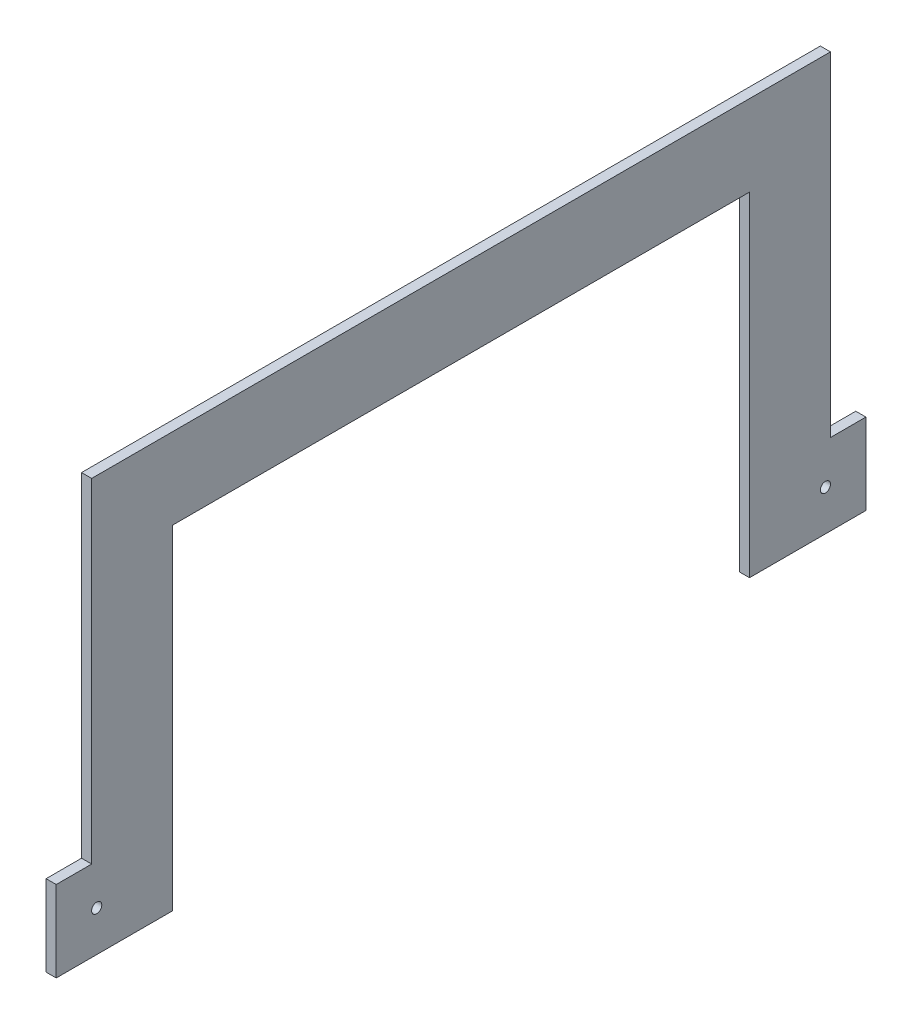
ISO-10303-21;
HEADER;
FILE_DESCRIPTION(('STEP AP214'),'2;1');
FILE_NAME('part.step','',(''),(''),'','','');
FILE_SCHEMA(('AUTOMOTIVE_DESIGN { 1 0 10303 214 1 1 1 1 }'));
ENDSEC;
DATA;
#1=APPLICATION_CONTEXT('core data for automotive mechanical design processes');
#2=APPLICATION_PROTOCOL_DEFINITION('international standard','automotive_design',2000,#1);
#3=PRODUCT_CONTEXT('',#1,'mechanical');
#4=PRODUCT('Part','Part','',(#3));
#5=PRODUCT_RELATED_PRODUCT_CATEGORY('part','',(#4));
#6=PRODUCT_DEFINITION_FORMATION('','',#4);
#7=PRODUCT_DEFINITION_CONTEXT('part definition',#1,'design');
#8=PRODUCT_DEFINITION('design','',#6,#7);
#9=PRODUCT_DEFINITION_SHAPE('','',#8);
#10=(LENGTH_UNIT() NAMED_UNIT(*) SI_UNIT(.MILLI.,.METRE.));
#11=(NAMED_UNIT(*) PLANE_ANGLE_UNIT() SI_UNIT($,.RADIAN.));
#12=(NAMED_UNIT(*) SI_UNIT($,.STERADIAN.) SOLID_ANGLE_UNIT());
#13=UNCERTAINTY_MEASURE_WITH_UNIT(LENGTH_MEASURE(1.E-05),#10,'distance_accuracy_value','');
#14=(GEOMETRIC_REPRESENTATION_CONTEXT(3) GLOBAL_UNCERTAINTY_ASSIGNED_CONTEXT((#13)) GLOBAL_UNIT_ASSIGNED_CONTEXT((#10,
#11,#12)) REPRESENTATION_CONTEXT('',''));
#15=CARTESIAN_POINT('',(0.,0.,0.));
#16=DIRECTION('',(0.,0.,1.));
#17=DIRECTION('',(1.,0.,0.));
#18=AXIS2_PLACEMENT_3D('',#15,#16,#17);
#19=CARTESIAN_POINT('',(3.175,0.,-90.4875));
#20=DIRECTION('',(0.,0.,-1.));
#21=DIRECTION('',(0.,1.,0.));
#22=AXIS2_PLACEMENT_3D('',#19,#20,#21);
#23=PLANE('',#22);
#24=DIRECTION('',(0.,-1.,0.));
#25=VECTOR('',#24,1.);
#26=CARTESIAN_POINT('',(0.,0.,-90.4875));
#27=LINE('',#26,#25);
#28=CARTESIAN_POINT('',(0.,0.,-90.4875));
#29=VERTEX_POINT('',#28);
#30=CARTESIAN_POINT('',(0.,-104.775,-90.4875));
#31=VERTEX_POINT('',#30);
#32=EDGE_CURVE('E154',#29,#31,#27,.T.);
#33=ORIENTED_EDGE('',*,*,#32,.T.);
#34=DIRECTION('',(-1.,0.,0.));
#35=VECTOR('',#34,1.);
#36=CARTESIAN_POINT('',(3.175,-104.775,-90.4875));
#37=LINE('',#36,#35);
#38=CARTESIAN_POINT('',(3.175,-104.775,-90.4875));
#39=VERTEX_POINT('',#38);
#40=EDGE_CURVE('E11',#39,#31,#37,.T.);
#41=ORIENTED_EDGE('',*,*,#40,.F.);
#42=DIRECTION('',(0.,-1.,0.));
#43=VECTOR('',#42,1.);
#44=CARTESIAN_POINT('',(3.175,0.,-90.4875));
#45=LINE('',#44,#43);
#46=CARTESIAN_POINT('',(3.175,0.,-90.4875));
#47=VERTEX_POINT('',#46);
#48=EDGE_CURVE('E177',#47,#39,#45,.T.);
#49=ORIENTED_EDGE('',*,*,#48,.F.);
#50=DIRECTION('',(-1.,0.,0.));
#51=VECTOR('',#50,1.);
#52=CARTESIAN_POINT('',(3.175,0.,-90.4875));
#53=LINE('',#52,#51);
#54=EDGE_CURVE('E150',#47,#29,#53,.T.);
#55=ORIENTED_EDGE('',*,*,#54,.T.);
#56=EDGE_LOOP('',(#33,#41,#49,#55));
#57=FACE_BOUND('',#56,.T.);
#58=ADVANCED_FACE('F34',(#57),#23,.F.);
#59=CARTESIAN_POINT('',(3.175,-104.775,-90.4875));
#60=DIRECTION('',(0.,1.,0.));
#61=DIRECTION('',(0.,0.,1.));
#62=AXIS2_PLACEMENT_3D('',#59,#60,#61);
#63=PLANE('',#62);
#64=DIRECTION('',(0.,0.,-1.));
#65=VECTOR('',#64,1.);
#66=CARTESIAN_POINT('',(0.,-104.775,-90.4875));
#67=LINE('',#66,#65);
#68=CARTESIAN_POINT('',(0.,-104.775,-127.));
#69=VERTEX_POINT('',#68);
#70=EDGE_CURVE('E157',#31,#69,#67,.T.);
#71=ORIENTED_EDGE('',*,*,#70,.T.);
#72=DIRECTION('',(-1.,0.,0.));
#73=VECTOR('',#72,1.);
#74=CARTESIAN_POINT('',(3.175,-104.775,-127.));
#75=LINE('',#74,#73);
#76=CARTESIAN_POINT('',(3.175,-104.775,-127.));
#77=VERTEX_POINT('',#76);
#78=EDGE_CURVE('E42',#77,#69,#75,.T.);
#79=ORIENTED_EDGE('',*,*,#78,.F.);
#80=DIRECTION('',(0.,0.,-1.));
#81=VECTOR('',#80,1.);
#82=CARTESIAN_POINT('',(3.175,-104.775,-90.4875));
#83=LINE('',#82,#81);
#84=EDGE_CURVE('E105',#39,#77,#83,.T.);
#85=ORIENTED_EDGE('',*,*,#84,.F.);
#86=ORIENTED_EDGE('',*,*,#40,.T.);
#87=EDGE_LOOP('',(#71,#79,#85,#86));
#88=FACE_BOUND('',#87,.T.);
#89=ADVANCED_FACE('F256',(#88),#63,.F.);
#90=CARTESIAN_POINT('',(3.175,-104.775,-127.));
#91=DIRECTION('',(0.,0.,1.));
#92=DIRECTION('',(1.,0.,0.));
#93=AXIS2_PLACEMENT_3D('',#90,#91,#92);
#94=PLANE('',#93);
#95=DIRECTION('',(0.,1.,0.));
#96=VECTOR('',#95,1.);
#97=CARTESIAN_POINT('',(0.,-104.775,-127.));
#98=LINE('',#97,#96);
#99=CARTESIAN_POINT('',(0.,-79.375,-127.));
#100=VERTEX_POINT('',#99);
#101=EDGE_CURVE('E160',#69,#100,#98,.T.);
#102=ORIENTED_EDGE('',*,*,#101,.T.);
#103=DIRECTION('',(-1.,0.,0.));
#104=VECTOR('',#103,1.);
#105=CARTESIAN_POINT('',(3.175,-79.375,-127.));
#106=LINE('',#105,#104);
#107=CARTESIAN_POINT('',(3.175,-79.375,-127.));
#108=VERTEX_POINT('',#107);
#109=EDGE_CURVE('E196',#108,#100,#106,.T.);
#110=ORIENTED_EDGE('',*,*,#109,.F.);
#111=DIRECTION('',(0.,1.,0.));
#112=VECTOR('',#111,1.);
#113=CARTESIAN_POINT('',(3.175,-104.775,-127.));
#114=LINE('',#113,#112);
#115=EDGE_CURVE('E204',#77,#108,#114,.T.);
#116=ORIENTED_EDGE('',*,*,#115,.F.);
#117=ORIENTED_EDGE('',*,*,#78,.T.);
#118=EDGE_LOOP('',(#102,#110,#116,#117));
#119=FACE_BOUND('',#118,.T.);
#120=ADVANCED_FACE('F202',(#119),#94,.F.);
#121=CARTESIAN_POINT('',(3.175,-79.375,-127.));
#122=DIRECTION('',(0.,-1.,0.));
#123=DIRECTION('',(0.,0.,-1.));
#124=AXIS2_PLACEMENT_3D('',#121,#122,#123);
#125=PLANE('',#124);
#126=DIRECTION('',(0.,0.,1.));
#127=VECTOR('',#126,1.);
#128=CARTESIAN_POINT('',(0.,-79.375,-127.));
#129=LINE('',#128,#127);
#130=CARTESIAN_POINT('',(0.,-79.375,-115.8875));
#131=VERTEX_POINT('',#130);
#132=EDGE_CURVE('E162',#100,#131,#129,.T.);
#133=ORIENTED_EDGE('',*,*,#132,.T.);
#134=DIRECTION('',(-1.,0.,0.));
#135=VECTOR('',#134,1.);
#136=CARTESIAN_POINT('',(3.175,-79.375,-115.8875));
#137=LINE('',#136,#135);
#138=CARTESIAN_POINT('',(3.175,-79.375,-115.8875));
#139=VERTEX_POINT('',#138);
#140=EDGE_CURVE('E193',#139,#131,#137,.T.);
#141=ORIENTED_EDGE('',*,*,#140,.F.);
#142=DIRECTION('',(0.,0.,1.));
#143=VECTOR('',#142,1.);
#144=CARTESIAN_POINT('',(3.175,-79.375,-127.));
#145=LINE('',#144,#143);
#146=EDGE_CURVE('E222',#108,#139,#145,.T.);
#147=ORIENTED_EDGE('',*,*,#146,.F.);
#148=ORIENTED_EDGE('',*,*,#109,.T.);
#149=EDGE_LOOP('',(#133,#141,#147,#148));
#150=FACE_BOUND('',#149,.T.);
#151=ADVANCED_FACE('F213',(#150),#125,.F.);
#152=CARTESIAN_POINT('',(3.175,-79.375,-115.8875));
#153=DIRECTION('',(0.,0.,1.));
#154=DIRECTION('',(1.,0.,0.));
#155=AXIS2_PLACEMENT_3D('',#152,#153,#154);
#156=PLANE('',#155);
#157=DIRECTION('',(0.,1.,0.));
#158=VECTOR('',#157,1.);
#159=CARTESIAN_POINT('',(0.,-79.375,-115.8875));
#160=LINE('',#159,#158);
#161=CARTESIAN_POINT('',(0.,25.4000000000001,-115.8875));
#162=VERTEX_POINT('',#161);
#163=EDGE_CURVE('E164',#131,#162,#160,.T.);
#164=ORIENTED_EDGE('',*,*,#163,.T.);
#165=DIRECTION('',(-1.,0.,0.));
#166=VECTOR('',#165,1.);
#167=CARTESIAN_POINT('',(3.175,25.4000000000001,-115.8875));
#168=LINE('',#167,#166);
#169=CARTESIAN_POINT('',(3.175,25.4000000000001,-115.8875));
#170=VERTEX_POINT('',#169);
#171=EDGE_CURVE('E190',#170,#162,#168,.T.);
#172=ORIENTED_EDGE('',*,*,#171,.F.);
#173=DIRECTION('',(0.,1.,0.));
#174=VECTOR('',#173,1.);
#175=CARTESIAN_POINT('',(3.175,-79.375,-115.8875));
#176=LINE('',#175,#174);
#177=EDGE_CURVE('E219',#139,#170,#176,.T.);
#178=ORIENTED_EDGE('',*,*,#177,.F.);
#179=ORIENTED_EDGE('',*,*,#140,.T.);
#180=EDGE_LOOP('',(#164,#172,#178,#179));
#181=FACE_BOUND('',#180,.T.);
#182=ADVANCED_FACE('F217',(#181),#156,.F.);
#183=CARTESIAN_POINT('',(3.175,25.4000000000001,-115.8875));
#184=DIRECTION('',(0.,-1.,0.));
#185=DIRECTION('',(0.,0.,-1.));
#186=AXIS2_PLACEMENT_3D('',#183,#184,#185);
#187=PLANE('',#186);
#188=DIRECTION('',(0.,0.,1.));
#189=VECTOR('',#188,1.);
#190=CARTESIAN_POINT('',(0.,25.4000000000001,-115.8875));
#191=LINE('',#190,#189);
#192=CARTESIAN_POINT('',(0.,25.4,115.8875));
#193=VERTEX_POINT('',#192);
#194=EDGE_CURVE('E166',#162,#193,#191,.T.);
#195=ORIENTED_EDGE('',*,*,#194,.T.);
#196=DIRECTION('',(-1.,0.,0.));
#197=VECTOR('',#196,1.);
#198=CARTESIAN_POINT('',(3.175,25.4,115.8875));
#199=LINE('',#198,#197);
#200=CARTESIAN_POINT('',(3.175,25.4,115.8875));
#201=VERTEX_POINT('',#200);
#202=EDGE_CURVE('E187',#201,#193,#199,.T.);
#203=ORIENTED_EDGE('',*,*,#202,.F.);
#204=DIRECTION('',(0.,0.,1.));
#205=VECTOR('',#204,1.);
#206=CARTESIAN_POINT('',(3.175,25.4000000000001,-115.8875));
#207=LINE('',#206,#205);
#208=EDGE_CURVE('E221',#170,#201,#207,.T.);
#209=ORIENTED_EDGE('',*,*,#208,.F.);
#210=ORIENTED_EDGE('',*,*,#171,.T.);
#211=EDGE_LOOP('',(#195,#203,#209,#210));
#212=FACE_BOUND('',#211,.T.);
#213=ADVANCED_FACE('F269',(#212),#187,.F.);
#214=CARTESIAN_POINT('',(3.175,25.4,115.8875));
#215=DIRECTION('',(0.,0.,-1.));
#216=DIRECTION('',(0.,1.,0.));
#217=AXIS2_PLACEMENT_3D('',#214,#215,#216);
#218=PLANE('',#217);
#219=DIRECTION('',(0.,-1.,0.));
#220=VECTOR('',#219,1.);
#221=CARTESIAN_POINT('',(0.,25.4,115.8875));
#222=LINE('',#221,#220);
#223=CARTESIAN_POINT('',(0.,-79.375,115.8875));
#224=VERTEX_POINT('',#223);
#225=EDGE_CURVE('E168',#193,#224,#222,.T.);
#226=ORIENTED_EDGE('',*,*,#225,.T.);
#227=DIRECTION('',(-1.,0.,0.));
#228=VECTOR('',#227,1.);
#229=CARTESIAN_POINT('',(3.175,-79.375,115.8875));
#230=LINE('',#229,#228);
#231=CARTESIAN_POINT('',(3.175,-79.375,115.8875));
#232=VERTEX_POINT('',#231);
#233=EDGE_CURVE('E184',#232,#224,#230,.T.);
#234=ORIENTED_EDGE('',*,*,#233,.F.);
#235=DIRECTION('',(0.,-1.,0.));
#236=VECTOR('',#235,1.);
#237=CARTESIAN_POINT('',(3.175,25.4,115.8875));
#238=LINE('',#237,#236);
#239=EDGE_CURVE('E224',#201,#232,#238,.T.);
#240=ORIENTED_EDGE('',*,*,#239,.F.);
#241=ORIENTED_EDGE('',*,*,#202,.T.);
#242=EDGE_LOOP('',(#226,#234,#240,#241));
#243=FACE_BOUND('',#242,.T.);
#244=ADVANCED_FACE('F272',(#243),#218,.F.);
#245=CARTESIAN_POINT('',(3.175,-79.375,115.8875));
#246=DIRECTION('',(0.,-1.,0.));
#247=DIRECTION('',(0.,0.,-1.));
#248=AXIS2_PLACEMENT_3D('',#245,#246,#247);
#249=PLANE('',#248);
#250=DIRECTION('',(0.,0.,1.));
#251=VECTOR('',#250,1.);
#252=CARTESIAN_POINT('',(0.,-79.375,115.8875));
#253=LINE('',#252,#251);
#254=CARTESIAN_POINT('',(0.,-79.375,127.));
#255=VERTEX_POINT('',#254);
#256=EDGE_CURVE('E170',#224,#255,#253,.T.);
#257=ORIENTED_EDGE('',*,*,#256,.T.);
#258=DIRECTION('',(-1.,0.,0.));
#259=VECTOR('',#258,1.);
#260=CARTESIAN_POINT('',(3.175,-79.375,127.));
#261=LINE('',#260,#259);
#262=CARTESIAN_POINT('',(3.175,-79.375,127.));
#263=VERTEX_POINT('',#262);
#264=EDGE_CURVE('E181',#263,#255,#261,.T.);
#265=ORIENTED_EDGE('',*,*,#264,.F.);
#266=DIRECTION('',(0.,0.,1.));
#267=VECTOR('',#266,1.);
#268=CARTESIAN_POINT('',(3.175,-79.375,115.8875));
#269=LINE('',#268,#267);
#270=EDGE_CURVE('E230',#232,#263,#269,.T.);
#271=ORIENTED_EDGE('',*,*,#270,.F.);
#272=ORIENTED_EDGE('',*,*,#233,.T.);
#273=EDGE_LOOP('',(#257,#265,#271,#272));
#274=FACE_BOUND('',#273,.T.);
#275=ADVANCED_FACE('F236',(#274),#249,.F.);
#276=CARTESIAN_POINT('',(3.175,-79.375,127.));
#277=DIRECTION('',(0.,0.,-1.));
#278=DIRECTION('',(-1.,0.,0.));
#279=AXIS2_PLACEMENT_3D('',#276,#277,#278);
#280=PLANE('',#279);
#281=DIRECTION('',(0.,-1.,0.));
#282=VECTOR('',#281,1.);
#283=CARTESIAN_POINT('',(0.,-79.375,127.));
#284=LINE('',#283,#282);
#285=CARTESIAN_POINT('',(0.,-104.775,127.));
#286=VERTEX_POINT('',#285);
#287=EDGE_CURVE('E172',#255,#286,#284,.T.);
#288=ORIENTED_EDGE('',*,*,#287,.T.);
#289=DIRECTION('',(-1.,0.,0.));
#290=VECTOR('',#289,1.);
#291=CARTESIAN_POINT('',(3.175,-104.775,127.));
#292=LINE('',#291,#290);
#293=CARTESIAN_POINT('',(3.175,-104.775,127.));
#294=VERTEX_POINT('',#293);
#295=EDGE_CURVE('E145',#294,#286,#292,.T.);
#296=ORIENTED_EDGE('',*,*,#295,.F.);
#297=DIRECTION('',(0.,-1.,0.));
#298=VECTOR('',#297,1.);
#299=CARTESIAN_POINT('',(3.175,-79.375,127.));
#300=LINE('',#299,#298);
#301=EDGE_CURVE('E136',#263,#294,#300,.T.);
#302=ORIENTED_EDGE('',*,*,#301,.F.);
#303=ORIENTED_EDGE('',*,*,#264,.T.);
#304=EDGE_LOOP('',(#288,#296,#302,#303));
#305=FACE_BOUND('',#304,.T.);
#306=ADVANCED_FACE('F240',(#305),#280,.F.);
#307=CARTESIAN_POINT('',(3.175,-104.775,127.));
#308=DIRECTION('',(0.,1.,0.));
#309=DIRECTION('',(0.,0.,1.));
#310=AXIS2_PLACEMENT_3D('',#307,#308,#309);
#311=PLANE('',#310);
#312=DIRECTION('',(0.,0.,-1.));
#313=VECTOR('',#312,1.);
#314=CARTESIAN_POINT('',(0.,-104.775,127.));
#315=LINE('',#314,#313);
#316=CARTESIAN_POINT('',(0.,-104.775,90.4875));
#317=VERTEX_POINT('',#316);
#318=EDGE_CURVE('E144',#286,#317,#315,.T.);
#319=ORIENTED_EDGE('',*,*,#318,.T.);
#320=DIRECTION('',(-1.,0.,0.));
#321=VECTOR('',#320,1.);
#322=CARTESIAN_POINT('',(3.175,-104.775,90.4875));
#323=LINE('',#322,#321);
#324=CARTESIAN_POINT('',(3.175,-104.775,90.4875));
#325=VERTEX_POINT('',#324);
#326=EDGE_CURVE('E141',#325,#317,#323,.T.);
#327=ORIENTED_EDGE('',*,*,#326,.F.);
#328=DIRECTION('',(0.,0.,-1.));
#329=VECTOR('',#328,1.);
#330=CARTESIAN_POINT('',(3.175,-104.775,127.));
#331=LINE('',#330,#329);
#332=EDGE_CURVE('E130',#294,#325,#331,.T.);
#333=ORIENTED_EDGE('',*,*,#332,.F.);
#334=ORIENTED_EDGE('',*,*,#295,.T.);
#335=EDGE_LOOP('',(#319,#327,#333,#334));
#336=FACE_BOUND('',#335,.T.);
#337=ADVANCED_FACE('F142',(#336),#311,.F.);
#338=CARTESIAN_POINT('',(3.175,-104.775,90.4875));
#339=DIRECTION('',(0.,0.,1.));
#340=DIRECTION('',(1.,0.,0.));
#341=AXIS2_PLACEMENT_3D('',#338,#339,#340);
#342=PLANE('',#341);
#343=DIRECTION('',(0.,1.,0.));
#344=VECTOR('',#343,1.);
#345=CARTESIAN_POINT('',(0.,-104.775,90.4875));
#346=LINE('',#345,#344);
#347=CARTESIAN_POINT('',(0.,0.,90.4875));
#348=VERTEX_POINT('',#347);
#349=EDGE_CURVE('E91',#317,#348,#346,.T.);
#350=ORIENTED_EDGE('',*,*,#349,.T.);
#351=DIRECTION('',(-1.,0.,0.));
#352=VECTOR('',#351,1.);
#353=CARTESIAN_POINT('',(3.175,0.,90.4875));
#354=LINE('',#353,#352);
#355=CARTESIAN_POINT('',(3.175,0.,90.4875));
#356=VERTEX_POINT('',#355);
#357=EDGE_CURVE('E146',#356,#348,#354,.T.);
#358=ORIENTED_EDGE('',*,*,#357,.F.);
#359=DIRECTION('',(0.,1.,0.));
#360=VECTOR('',#359,1.);
#361=CARTESIAN_POINT('',(3.175,-104.775,90.4875));
#362=LINE('',#361,#360);
#363=EDGE_CURVE('E134',#325,#356,#362,.T.);
#364=ORIENTED_EDGE('',*,*,#363,.F.);
#365=ORIENTED_EDGE('',*,*,#326,.T.);
#366=EDGE_LOOP('',(#350,#358,#364,#365));
#367=FACE_BOUND('',#366,.T.);
#368=ADVANCED_FACE('F148',(#367),#342,.F.);
#369=CARTESIAN_POINT('',(3.175,0.,90.4875));
#370=DIRECTION('',(0.,1.,0.));
#371=DIRECTION('',(0.,0.,1.));
#372=AXIS2_PLACEMENT_3D('',#369,#370,#371);
#373=PLANE('',#372);
#374=DIRECTION('',(0.,0.,-1.));
#375=VECTOR('',#374,1.);
#376=CARTESIAN_POINT('',(0.,0.,90.4875));
#377=LINE('',#376,#375);
#378=EDGE_CURVE('E97',#348,#29,#377,.T.);
#379=ORIENTED_EDGE('',*,*,#378,.T.);
#380=ORIENTED_EDGE('',*,*,#54,.F.);
#381=DIRECTION('',(0.,0.,-1.));
#382=VECTOR('',#381,1.);
#383=CARTESIAN_POINT('',(3.175,0.,90.4875));
#384=LINE('',#383,#382);
#385=EDGE_CURVE('E50',#356,#47,#384,.T.);
#386=ORIENTED_EDGE('',*,*,#385,.F.);
#387=ORIENTED_EDGE('',*,*,#357,.T.);
#388=EDGE_LOOP('',(#379,#380,#386,#387));
#389=FACE_BOUND('',#388,.T.);
#390=ADVANCED_FACE('F244',(#389),#373,.F.);
#391=CARTESIAN_POINT('',(3.175,0.,0.));
#392=DIRECTION('',(1.,0.,0.));
#393=DIRECTION('',(0.,0.,-1.));
#394=AXIS2_PLACEMENT_3D('',#391,#392,#393);
#395=PLANE('',#394);
#396=CARTESIAN_POINT('',(3.175,-92.075,114.3));
#397=DIRECTION('',(1.,0.,0.));
#398=DIRECTION('',(0.,0.,-1.));
#399=AXIS2_PLACEMENT_3D('',#396,#397,#398);
#400=CIRCLE('',#399,1.5875);
#401=CARTESIAN_POINT('',(3.175,-92.075,112.7125));
#402=VERTEX_POINT('',#401);
#403=EDGE_CURVE('E337',#402,#402,#400,.T.);
#404=ORIENTED_EDGE('',*,*,#403,.F.);
#405=EDGE_LOOP('',(#404));
#406=FACE_BOUND('',#405,.T.);
#407=CARTESIAN_POINT('',(3.175,-92.075,-114.3));
#408=DIRECTION('',(1.,0.,0.));
#409=DIRECTION('',(0.,0.,-1.));
#410=AXIS2_PLACEMENT_3D('',#407,#408,#409);
#411=CIRCLE('',#410,1.5875);
#412=CARTESIAN_POINT('',(3.175,-92.075,-115.8875));
#413=VERTEX_POINT('',#412);
#414=EDGE_CURVE('E342',#413,#413,#411,.T.);
#415=ORIENTED_EDGE('',*,*,#414,.F.);
#416=EDGE_LOOP('',(#415));
#417=FACE_BOUND('',#416,.T.);
#418=ORIENTED_EDGE('',*,*,#48,.T.);
#419=ORIENTED_EDGE('',*,*,#84,.T.);
#420=ORIENTED_EDGE('',*,*,#115,.T.);
#421=ORIENTED_EDGE('',*,*,#146,.T.);
#422=ORIENTED_EDGE('',*,*,#177,.T.);
#423=ORIENTED_EDGE('',*,*,#208,.T.);
#424=ORIENTED_EDGE('',*,*,#239,.T.);
#425=ORIENTED_EDGE('',*,*,#270,.T.);
#426=ORIENTED_EDGE('',*,*,#301,.T.);
#427=ORIENTED_EDGE('',*,*,#332,.T.);
#428=ORIENTED_EDGE('',*,*,#363,.T.);
#429=ORIENTED_EDGE('',*,*,#385,.T.);
#430=EDGE_LOOP('',(#418,#419,#420,#421,#422,#423,#424,#425,#426,#427,#428,#429));
#431=FACE_BOUND('',#430,.T.);
#432=ADVANCED_FACE('F132',(#406,#417,#431),#395,.T.);
#433=CARTESIAN_POINT('',(0.,0.,0.));
#434=DIRECTION('',(1.,0.,0.));
#435=DIRECTION('',(0.,0.,-1.));
#436=AXIS2_PLACEMENT_3D('',#433,#434,#435);
#437=PLANE('',#436);
#438=CARTESIAN_POINT('',(0.,-92.075,114.3));
#439=DIRECTION('',(1.,0.,0.));
#440=DIRECTION('',(0.,0.,-1.));
#441=AXIS2_PLACEMENT_3D('',#438,#439,#440);
#442=CIRCLE('',#441,1.5875);
#443=CARTESIAN_POINT('',(0.,-92.075,112.7125));
#444=VERTEX_POINT('',#443);
#445=EDGE_CURVE('E158',#444,#444,#442,.T.);
#446=ORIENTED_EDGE('',*,*,#445,.T.);
#447=EDGE_LOOP('',(#446));
#448=FACE_BOUND('',#447,.T.);
#449=CARTESIAN_POINT('',(0.,-92.075,-114.3));
#450=DIRECTION('',(1.,0.,0.));
#451=DIRECTION('',(0.,0.,-1.));
#452=AXIS2_PLACEMENT_3D('',#449,#450,#451);
#453=CIRCLE('',#452,1.5875);
#454=CARTESIAN_POINT('',(0.,-92.075,-115.8875));
#455=VERTEX_POINT('',#454);
#456=EDGE_CURVE('E338',#455,#455,#453,.T.);
#457=ORIENTED_EDGE('',*,*,#456,.T.);
#458=EDGE_LOOP('',(#457));
#459=FACE_BOUND('',#458,.T.);
#460=ORIENTED_EDGE('',*,*,#32,.F.);
#461=ORIENTED_EDGE('',*,*,#378,.F.);
#462=ORIENTED_EDGE('',*,*,#349,.F.);
#463=ORIENTED_EDGE('',*,*,#318,.F.);
#464=ORIENTED_EDGE('',*,*,#287,.F.);
#465=ORIENTED_EDGE('',*,*,#256,.F.);
#466=ORIENTED_EDGE('',*,*,#225,.F.);
#467=ORIENTED_EDGE('',*,*,#194,.F.);
#468=ORIENTED_EDGE('',*,*,#163,.F.);
#469=ORIENTED_EDGE('',*,*,#132,.F.);
#470=ORIENTED_EDGE('',*,*,#101,.F.);
#471=ORIENTED_EDGE('',*,*,#70,.F.);
#472=EDGE_LOOP('',(#460,#461,#462,#463,#464,#465,#466,#467,#468,#469,#470,#471));
#473=FACE_BOUND('',#472,.T.);
#474=ADVANCED_FACE('F208',(#448,#459,#473),#437,.F.);
#475=CARTESIAN_POINT('',(0.,-92.075,-114.3));
#476=DIRECTION('',(1.,0.,0.));
#477=DIRECTION('',(0.,0.,-1.));
#478=AXIS2_PLACEMENT_3D('',#475,#476,#477);
#479=CYLINDRICAL_SURFACE('',#478,1.5875);
#480=ORIENTED_EDGE('',*,*,#456,.F.);
#481=EDGE_LOOP('',(#480));
#482=FACE_BOUND('',#481,.T.);
#483=ORIENTED_EDGE('',*,*,#414,.T.);
#484=EDGE_LOOP('',(#483));
#485=FACE_BOUND('',#484,.T.);
#486=ADVANCED_FACE('F309',(#482,#485),#479,.F.);
#487=CARTESIAN_POINT('',(0.,-92.075,114.3));
#488=DIRECTION('',(1.,0.,0.));
#489=DIRECTION('',(0.,0.,-1.));
#490=AXIS2_PLACEMENT_3D('',#487,#488,#489);
#491=CYLINDRICAL_SURFACE('',#490,1.5875);
#492=ORIENTED_EDGE('',*,*,#445,.F.);
#493=EDGE_LOOP('',(#492));
#494=FACE_BOUND('',#493,.T.);
#495=ORIENTED_EDGE('',*,*,#403,.T.);
#496=EDGE_LOOP('',(#495));
#497=FACE_BOUND('',#496,.T.);
#498=ADVANCED_FACE('F318',(#494,#497),#491,.F.);
#499=CLOSED_SHELL('',(#58,#89,#120,#151,#182,#213,#244,#275,#306,#337,#368,#390,#432,#474,#486,#498));
#500=MANIFOLD_SOLID_BREP('B2',#499);
#501=ADVANCED_BREP_SHAPE_REPRESENTATION('',(#18,#500),#14);
#502=SHAPE_DEFINITION_REPRESENTATION(#9,#501);
ENDSEC;
END-ISO-10303-21;
